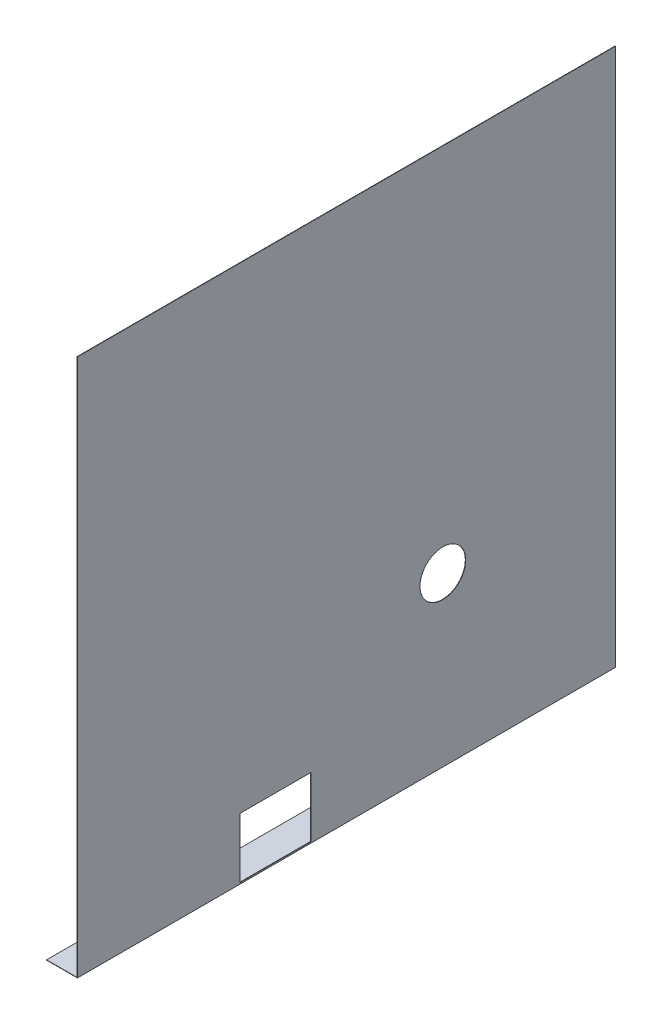
ISO-10303-21;
HEADER;
FILE_DESCRIPTION(('STEP AP214'),'2;1');
FILE_NAME('part.step','',(''),(''),'','','');
FILE_SCHEMA(('AUTOMOTIVE_DESIGN { 1 0 10303 214 1 1 1 1 }'));
ENDSEC;
DATA;
#1=APPLICATION_CONTEXT('core data for automotive mechanical design processes');
#2=APPLICATION_PROTOCOL_DEFINITION('international standard','automotive_design',2000,#1);
#3=PRODUCT_CONTEXT('',#1,'mechanical');
#4=PRODUCT('Part','Part','',(#3));
#5=PRODUCT_RELATED_PRODUCT_CATEGORY('part','',(#4));
#6=PRODUCT_DEFINITION_FORMATION('','',#4);
#7=PRODUCT_DEFINITION_CONTEXT('part definition',#1,'design');
#8=PRODUCT_DEFINITION('design','',#6,#7);
#9=PRODUCT_DEFINITION_SHAPE('','',#8);
#10=(LENGTH_UNIT() NAMED_UNIT(*) SI_UNIT(.MILLI.,.METRE.));
#11=(NAMED_UNIT(*) PLANE_ANGLE_UNIT() SI_UNIT($,.RADIAN.));
#12=(NAMED_UNIT(*) SI_UNIT($,.STERADIAN.) SOLID_ANGLE_UNIT());
#13=UNCERTAINTY_MEASURE_WITH_UNIT(LENGTH_MEASURE(1.E-05),#10,'distance_accuracy_value','');
#14=(GEOMETRIC_REPRESENTATION_CONTEXT(3) GLOBAL_UNCERTAINTY_ASSIGNED_CONTEXT((#13)) GLOBAL_UNIT_ASSIGNED_CONTEXT((#10,
#11,#12)) REPRESENTATION_CONTEXT('',''));
#15=CARTESIAN_POINT('',(0.,0.,0.));
#16=DIRECTION('',(0.,0.,1.));
#17=DIRECTION('',(1.,0.,0.));
#18=AXIS2_PLACEMENT_3D('',#15,#16,#17);
#19=CARTESIAN_POINT('',(-30.3499999999999,0.,530.));
#20=DIRECTION('',(0.,1.,0.));
#21=DIRECTION('',(0.,0.,1.));
#22=AXIS2_PLACEMENT_3D('',#19,#20,#21);
#23=PLANE('',#22);
#24=DIRECTION('',(1.,0.,0.));
#25=VECTOR('',#24,1.);
#26=CARTESIAN_POINT('',(-30.3499999999999,0.,0.));
#27=LINE('',#26,#25);
#28=CARTESIAN_POINT('',(-30.3499999999999,0.,0.));
#29=VERTEX_POINT('',#28);
#30=CARTESIAN_POINT('',(0.,0.,0.));
#31=VERTEX_POINT('',#30);
#32=EDGE_CURVE('E172',#29,#31,#27,.T.);
#33=ORIENTED_EDGE('',*,*,#32,.T.);
#34=DIRECTION('',(0.,0.,-1.));
#35=VECTOR('',#34,1.);
#36=CARTESIAN_POINT('',(0.,0.,530.));
#37=LINE('',#36,#35);
#38=CARTESIAN_POINT('',(0.,0.,530.));
#39=VERTEX_POINT('',#38);
#40=EDGE_CURVE('E11',#39,#31,#37,.T.);
#41=ORIENTED_EDGE('',*,*,#40,.F.);
#42=DIRECTION('',(1.,0.,0.));
#43=VECTOR('',#42,1.);
#44=CARTESIAN_POINT('',(-30.3499999999999,0.,530.));
#45=LINE('',#44,#43);
#46=CARTESIAN_POINT('',(-30.3499999999999,0.,530.));
#47=VERTEX_POINT('',#46);
#48=EDGE_CURVE('E173',#47,#39,#45,.T.);
#49=ORIENTED_EDGE('',*,*,#48,.F.);
#50=DIRECTION('',(0.,0.,-1.));
#51=VECTOR('',#50,1.);
#52=CARTESIAN_POINT('',(-30.3499999999999,0.,530.));
#53=LINE('',#52,#51);
#54=EDGE_CURVE('E193',#47,#29,#53,.T.);
#55=ORIENTED_EDGE('',*,*,#54,.T.);
#56=EDGE_LOOP('',(#33,#41,#49,#55));
#57=FACE_BOUND('',#56,.T.);
#58=ADVANCED_FACE('F39',(#57),#23,.F.);
#59=CARTESIAN_POINT('',(0.,0.,530.));
#60=DIRECTION('',(-1.,0.,0.));
#61=DIRECTION('',(0.,0.,1.));
#62=AXIS2_PLACEMENT_3D('',#59,#60,#61);
#63=PLANE('',#62);
#64=DIRECTION('',(0.,-1.,0.));
#65=VECTOR('',#64,1.);
#66=CARTESIAN_POINT('',(0.,-2.16399403104903E-13,300.));
#67=LINE('',#66,#65);
#68=CARTESIAN_POINT('',(0.,60.35,300.));
#69=VERTEX_POINT('',#68);
#70=CARTESIAN_POINT('',(0.,1.34999999999999,300.));
#71=VERTEX_POINT('',#70);
#72=EDGE_CURVE('E156',#69,#71,#67,.T.);
#73=ORIENTED_EDGE('',*,*,#72,.T.);
#74=DIRECTION('',(0.,0.,1.));
#75=VECTOR('',#74,1.);
#76=CARTESIAN_POINT('',(0.,1.35000000000006,530.));
#77=LINE('',#76,#75);
#78=CARTESIAN_POINT('',(0.,1.35000000000001,370.));
#79=VERTEX_POINT('',#78);
#80=EDGE_CURVE('E160',#71,#79,#77,.T.);
#81=ORIENTED_EDGE('',*,*,#80,.T.);
#82=DIRECTION('',(0.,1.,0.));
#83=VECTOR('',#82,1.);
#84=CARTESIAN_POINT('',(0.,0.,370.));
#85=LINE('',#84,#83);
#86=CARTESIAN_POINT('',(0.,60.3500000000001,370.));
#87=VERTEX_POINT('',#86);
#88=EDGE_CURVE('E147',#79,#87,#85,.T.);
#89=ORIENTED_EDGE('',*,*,#88,.T.);
#90=DIRECTION('',(0.,0.,-1.));
#91=VECTOR('',#90,1.);
#92=CARTESIAN_POINT('',(0.,60.35,530.));
#93=LINE('',#92,#91);
#94=EDGE_CURVE('E122',#87,#69,#93,.T.);
#95=ORIENTED_EDGE('',*,*,#94,.T.);
#96=EDGE_LOOP('',(#73,#81,#89,#95));
#97=FACE_BOUND('',#96,.T.);
#98=CARTESIAN_POINT('',(0.,165.35,170.));
#99=DIRECTION('',(-1.,0.,0.));
#100=DIRECTION('',(0.,0.,1.));
#101=AXIS2_PLACEMENT_3D('',#98,#99,#100);
#102=CIRCLE('',#101,22.5);
#103=CARTESIAN_POINT('',(0.,165.35,192.5));
#104=VERTEX_POINT('',#103);
#105=EDGE_CURVE('E168',#104,#104,#102,.T.);
#106=ORIENTED_EDGE('',*,*,#105,.T.);
#107=EDGE_LOOP('',(#106));
#108=FACE_BOUND('',#107,.T.);
#109=DIRECTION('',(0.,1.,0.));
#110=VECTOR('',#109,1.);
#111=CARTESIAN_POINT('',(0.,0.,0.));
#112=LINE('',#111,#110);
#113=CARTESIAN_POINT('',(0.,530.,0.));
#114=VERTEX_POINT('',#113);
#115=EDGE_CURVE('E197',#31,#114,#112,.T.);
#116=ORIENTED_EDGE('',*,*,#115,.T.);
#117=DIRECTION('',(0.,0.,-1.));
#118=VECTOR('',#117,1.);
#119=CARTESIAN_POINT('',(0.,530.,530.));
#120=LINE('',#119,#118);
#121=CARTESIAN_POINT('',(0.,530.,530.));
#122=VERTEX_POINT('',#121);
#123=EDGE_CURVE('E47',#122,#114,#120,.T.);
#124=ORIENTED_EDGE('',*,*,#123,.F.);
#125=DIRECTION('',(0.,1.,0.));
#126=VECTOR('',#125,1.);
#127=CARTESIAN_POINT('',(0.,0.,530.));
#128=LINE('',#127,#126);
#129=EDGE_CURVE('E177',#39,#122,#128,.T.);
#130=ORIENTED_EDGE('',*,*,#129,.F.);
#131=ORIENTED_EDGE('',*,*,#40,.T.);
#132=EDGE_LOOP('',(#116,#124,#130,#131));
#133=FACE_BOUND('',#132,.T.);
#134=ADVANCED_FACE('F253',(#97,#108,#133),#63,.F.);
#135=CARTESIAN_POINT('',(0.,530.,530.));
#136=DIRECTION('',(0.,-1.,0.));
#137=DIRECTION('',(0.,0.,-1.));
#138=AXIS2_PLACEMENT_3D('',#135,#136,#137);
#139=PLANE('',#138);
#140=DIRECTION('',(-1.,0.,0.));
#141=VECTOR('',#140,1.);
#142=CARTESIAN_POINT('',(0.,530.,0.));
#143=LINE('',#142,#141);
#144=CARTESIAN_POINT('',(-0.349999999999989,530.,0.));
#145=VERTEX_POINT('',#144);
#146=EDGE_CURVE('E200',#114,#145,#143,.T.);
#147=ORIENTED_EDGE('',*,*,#146,.T.);
#148=DIRECTION('',(0.,0.,-1.));
#149=VECTOR('',#148,1.);
#150=CARTESIAN_POINT('',(-0.349999999999989,530.,530.));
#151=LINE('',#150,#149);
#152=CARTESIAN_POINT('',(-0.349999999999989,530.,530.));
#153=VERTEX_POINT('',#152);
#154=EDGE_CURVE('E222',#153,#145,#151,.T.);
#155=ORIENTED_EDGE('',*,*,#154,.F.);
#156=DIRECTION('',(-1.,0.,0.));
#157=VECTOR('',#156,1.);
#158=CARTESIAN_POINT('',(0.,530.,530.));
#159=LINE('',#158,#157);
#160=EDGE_CURVE('E181',#122,#153,#159,.T.);
#161=ORIENTED_EDGE('',*,*,#160,.F.);
#162=ORIENTED_EDGE('',*,*,#123,.T.);
#163=EDGE_LOOP('',(#147,#155,#161,#162));
#164=FACE_BOUND('',#163,.T.);
#165=ADVANCED_FACE('F231',(#164),#139,.F.);
#166=CARTESIAN_POINT('',(-0.349999999999989,530.,530.));
#167=DIRECTION('',(1.,0.,0.));
#168=DIRECTION('',(0.,1.,0.));
#169=AXIS2_PLACEMENT_3D('',#166,#167,#168);
#170=PLANE('',#169);
#171=DIRECTION('',(0.,1.,0.));
#172=VECTOR('',#171,1.);
#173=CARTESIAN_POINT('',(-0.349999999999909,60.35,370.));
#174=LINE('',#173,#172);
#175=CARTESIAN_POINT('',(-0.349999999999899,1.35000000000007,370.));
#176=VERTEX_POINT('',#175);
#177=CARTESIAN_POINT('',(-0.349999999999909,60.35,370.));
#178=VERTEX_POINT('',#177);
#179=EDGE_CURVE('E129',#176,#178,#174,.T.);
#180=ORIENTED_EDGE('',*,*,#179,.F.);
#181=DIRECTION('',(0.,0.,1.));
#182=VECTOR('',#181,1.);
#183=CARTESIAN_POINT('',(-0.349999999999899,1.35000000000001,370.));
#184=LINE('',#183,#182);
#185=CARTESIAN_POINT('',(-0.349999999999899,1.34999999999999,300.));
#186=VERTEX_POINT('',#185);
#187=EDGE_CURVE('E62',#186,#176,#184,.T.);
#188=ORIENTED_EDGE('',*,*,#187,.F.);
#189=DIRECTION('',(0.,-1.,0.));
#190=VECTOR('',#189,1.);
#191=CARTESIAN_POINT('',(-0.349999999999899,1.34999999999999,300.));
#192=LINE('',#191,#190);
#193=CARTESIAN_POINT('',(-0.349999999999909,60.35,300.));
#194=VERTEX_POINT('',#193);
#195=EDGE_CURVE('E137',#194,#186,#192,.T.);
#196=ORIENTED_EDGE('',*,*,#195,.F.);
#197=DIRECTION('',(0.,0.,-1.));
#198=VECTOR('',#197,1.);
#199=CARTESIAN_POINT('',(-0.349999999999909,60.35,300.));
#200=LINE('',#199,#198);
#201=EDGE_CURVE('E119',#178,#194,#200,.T.);
#202=ORIENTED_EDGE('',*,*,#201,.F.);
#203=EDGE_LOOP('',(#180,#188,#196,#202));
#204=FACE_BOUND('',#203,.T.);
#205=CARTESIAN_POINT('',(-0.349999999999927,165.35,170.));
#206=DIRECTION('',(-1.,0.,0.));
#207=DIRECTION('',(0.,-1.,0.));
#208=AXIS2_PLACEMENT_3D('',#205,#206,#207);
#209=CIRCLE('',#208,22.5);
#210=CARTESIAN_POINT('',(-0.349999999999923,142.85,170.));
#211=VERTEX_POINT('',#210);
#212=EDGE_CURVE('E164',#211,#211,#209,.T.);
#213=ORIENTED_EDGE('',*,*,#212,.F.);
#214=EDGE_LOOP('',(#213));
#215=FACE_BOUND('',#214,.T.);
#216=DIRECTION('',(0.,-1.,0.));
#217=VECTOR('',#216,1.);
#218=CARTESIAN_POINT('',(-0.349999999999989,530.,0.));
#219=LINE('',#218,#217);
#220=CARTESIAN_POINT('',(-0.349999999999899,0.35000000000001,0.));
#221=VERTEX_POINT('',#220);
#222=EDGE_CURVE('E203',#145,#221,#219,.T.);
#223=ORIENTED_EDGE('',*,*,#222,.T.);
#224=DIRECTION('',(0.,0.,-1.));
#225=VECTOR('',#224,1.);
#226=CARTESIAN_POINT('',(-0.349999999999899,0.35000000000001,530.));
#227=LINE('',#226,#225);
#228=CARTESIAN_POINT('',(-0.349999999999899,0.35000000000001,530.));
#229=VERTEX_POINT('',#228);
#230=EDGE_CURVE('E218',#229,#221,#227,.T.);
#231=ORIENTED_EDGE('',*,*,#230,.F.);
#232=DIRECTION('',(0.,-1.,0.));
#233=VECTOR('',#232,1.);
#234=CARTESIAN_POINT('',(-0.349999999999989,530.,530.));
#235=LINE('',#234,#233);
#236=EDGE_CURVE('E184',#153,#229,#235,.T.);
#237=ORIENTED_EDGE('',*,*,#236,.F.);
#238=ORIENTED_EDGE('',*,*,#154,.T.);
#239=EDGE_LOOP('',(#223,#231,#237,#238));
#240=FACE_BOUND('',#239,.T.);
#241=ADVANCED_FACE('F134',(#204,#215,#240),#170,.F.);
#242=CARTESIAN_POINT('',(-0.349999999999899,0.35000000000001,530.));
#243=DIRECTION('',(0.,-1.,0.));
#244=DIRECTION('',(1.,0.,0.));
#245=AXIS2_PLACEMENT_3D('',#242,#243,#244);
#246=PLANE('',#245);
#247=DIRECTION('',(-1.,0.,0.));
#248=VECTOR('',#247,1.);
#249=CARTESIAN_POINT('',(-0.349999999999899,0.35000000000001,0.));
#250=LINE('',#249,#248);
#251=CARTESIAN_POINT('',(-30.3499999999999,0.350000000000003,0.));
#252=VERTEX_POINT('',#251);
#253=EDGE_CURVE('E206',#221,#252,#250,.T.);
#254=ORIENTED_EDGE('',*,*,#253,.T.);
#255=DIRECTION('',(0.,0.,-1.));
#256=VECTOR('',#255,1.);
#257=CARTESIAN_POINT('',(-30.3499999999999,0.350000000000003,530.));
#258=LINE('',#257,#256);
#259=CARTESIAN_POINT('',(-30.3499999999999,0.350000000000003,530.));
#260=VERTEX_POINT('',#259);
#261=EDGE_CURVE('E214',#260,#252,#258,.T.);
#262=ORIENTED_EDGE('',*,*,#261,.F.);
#263=DIRECTION('',(-1.,0.,0.));
#264=VECTOR('',#263,1.);
#265=CARTESIAN_POINT('',(-0.349999999999899,0.35000000000001,530.));
#266=LINE('',#265,#264);
#267=EDGE_CURVE('E187',#229,#260,#266,.T.);
#268=ORIENTED_EDGE('',*,*,#267,.F.);
#269=ORIENTED_EDGE('',*,*,#230,.T.);
#270=EDGE_LOOP('',(#254,#262,#268,#269));
#271=FACE_BOUND('',#270,.T.);
#272=ADVANCED_FACE('F245',(#271),#246,.F.);
#273=CARTESIAN_POINT('',(-30.3499999999999,0.350000000000003,530.));
#274=DIRECTION('',(1.,0.,0.));
#275=DIRECTION('',(0.,1.,0.));
#276=AXIS2_PLACEMENT_3D('',#273,#274,#275);
#277=PLANE('',#276);
#278=DIRECTION('',(0.,-1.,0.));
#279=VECTOR('',#278,1.);
#280=CARTESIAN_POINT('',(-30.3499999999999,0.350000000000003,0.));
#281=LINE('',#280,#279);
#282=EDGE_CURVE('E178',#252,#29,#281,.T.);
#283=ORIENTED_EDGE('',*,*,#282,.T.);
#284=ORIENTED_EDGE('',*,*,#54,.F.);
#285=DIRECTION('',(0.,-1.,0.));
#286=VECTOR('',#285,1.);
#287=CARTESIAN_POINT('',(-30.3499999999999,0.350000000000003,530.));
#288=LINE('',#287,#286);
#289=EDGE_CURVE('E190',#260,#47,#288,.T.);
#290=ORIENTED_EDGE('',*,*,#289,.F.);
#291=ORIENTED_EDGE('',*,*,#261,.T.);
#292=EDGE_LOOP('',(#283,#284,#290,#291));
#293=FACE_BOUND('',#292,.T.);
#294=ADVANCED_FACE('F256',(#293),#277,.F.);
#295=CARTESIAN_POINT('',(0.,0.,530.));
#296=DIRECTION('',(0.,0.,1.));
#297=DIRECTION('',(1.,0.,0.));
#298=AXIS2_PLACEMENT_3D('',#295,#296,#297);
#299=PLANE('',#298);
#300=ORIENTED_EDGE('',*,*,#48,.T.);
#301=ORIENTED_EDGE('',*,*,#129,.T.);
#302=ORIENTED_EDGE('',*,*,#160,.T.);
#303=ORIENTED_EDGE('',*,*,#236,.T.);
#304=ORIENTED_EDGE('',*,*,#267,.T.);
#305=ORIENTED_EDGE('',*,*,#289,.T.);
#306=EDGE_LOOP('',(#300,#301,#302,#303,#304,#305));
#307=FACE_BOUND('',#306,.T.);
#308=ADVANCED_FACE('F249',(#307),#299,.T.);
#309=CARTESIAN_POINT('',(0.,0.,0.));
#310=DIRECTION('',(0.,0.,1.));
#311=DIRECTION('',(1.,0.,0.));
#312=AXIS2_PLACEMENT_3D('',#309,#310,#311);
#313=PLANE('',#312);
#314=ORIENTED_EDGE('',*,*,#32,.F.);
#315=ORIENTED_EDGE('',*,*,#282,.F.);
#316=ORIENTED_EDGE('',*,*,#253,.F.);
#317=ORIENTED_EDGE('',*,*,#222,.F.);
#318=ORIENTED_EDGE('',*,*,#146,.F.);
#319=ORIENTED_EDGE('',*,*,#115,.F.);
#320=EDGE_LOOP('',(#314,#315,#316,#317,#318,#319));
#321=FACE_BOUND('',#320,.T.);
#322=ADVANCED_FACE('F237',(#321),#313,.F.);
#323=CARTESIAN_POINT('',(529.65,165.35,170.));
#324=DIRECTION('',(-1.,0.,0.));
#325=DIRECTION('',(0.,-1.,0.));
#326=AXIS2_PLACEMENT_3D('',#323,#324,#325);
#327=CYLINDRICAL_SURFACE('',#326,22.5);
#328=ORIENTED_EDGE('',*,*,#212,.T.);
#329=EDGE_LOOP('',(#328));
#330=FACE_BOUND('',#329,.T.);
#331=ORIENTED_EDGE('',*,*,#105,.F.);
#332=EDGE_LOOP('',(#331));
#333=FACE_BOUND('',#332,.T.);
#334=ADVANCED_FACE('F308',(#330,#333),#327,.F.);
#335=CARTESIAN_POINT('',(529.65,1.3500000000001,370.));
#336=DIRECTION('',(0.,-1.,0.));
#337=DIRECTION('',(0.,0.,-1.));
#338=AXIS2_PLACEMENT_3D('',#335,#336,#337);
#339=PLANE('',#338);
#340=DIRECTION('',(-1.,0.,0.));
#341=VECTOR('',#340,1.);
#342=CARTESIAN_POINT('',(529.65,1.35000000000008,300.));
#343=LINE('',#342,#341);
#344=EDGE_CURVE('E144',#71,#186,#343,.T.);
#345=ORIENTED_EDGE('',*,*,#344,.T.);
#346=ORIENTED_EDGE('',*,*,#187,.T.);
#347=DIRECTION('',(-1.,0.,0.));
#348=VECTOR('',#347,1.);
#349=CARTESIAN_POINT('',(529.65,1.3500000000001,370.));
#350=LINE('',#349,#348);
#351=EDGE_CURVE('E126',#79,#176,#350,.T.);
#352=ORIENTED_EDGE('',*,*,#351,.F.);
#353=ORIENTED_EDGE('',*,*,#80,.F.);
#354=EDGE_LOOP('',(#345,#346,#352,#353));
#355=FACE_BOUND('',#354,.T.);
#356=ADVANCED_FACE('F315',(#355),#339,.F.);
#357=CARTESIAN_POINT('',(529.65,1.35000000000008,300.));
#358=DIRECTION('',(0.,0.,-1.));
#359=DIRECTION('',(0.,1.,0.));
#360=AXIS2_PLACEMENT_3D('',#357,#358,#359);
#361=PLANE('',#360);
#362=DIRECTION('',(-1.,0.,0.));
#363=VECTOR('',#362,1.);
#364=CARTESIAN_POINT('',(529.65,60.3500000000001,300.));
#365=LINE('',#364,#363);
#366=EDGE_CURVE('E125',#69,#194,#365,.T.);
#367=ORIENTED_EDGE('',*,*,#366,.T.);
#368=ORIENTED_EDGE('',*,*,#195,.T.);
#369=ORIENTED_EDGE('',*,*,#344,.F.);
#370=ORIENTED_EDGE('',*,*,#72,.F.);
#371=EDGE_LOOP('',(#367,#368,#369,#370));
#372=FACE_BOUND('',#371,.T.);
#373=ADVANCED_FACE('F337',(#372),#361,.F.);
#374=CARTESIAN_POINT('',(529.65,60.3500000000001,300.));
#375=DIRECTION('',(0.,1.,0.));
#376=DIRECTION('',(-1.,0.,0.));
#377=AXIS2_PLACEMENT_3D('',#374,#375,#376);
#378=PLANE('',#377);
#379=DIRECTION('',(-1.,0.,0.));
#380=VECTOR('',#379,1.);
#381=CARTESIAN_POINT('',(529.65,60.3500000000001,370.));
#382=LINE('',#381,#380);
#383=EDGE_CURVE('E54',#87,#178,#382,.T.);
#384=ORIENTED_EDGE('',*,*,#383,.T.);
#385=ORIENTED_EDGE('',*,*,#201,.T.);
#386=ORIENTED_EDGE('',*,*,#366,.F.);
#387=ORIENTED_EDGE('',*,*,#94,.F.);
#388=EDGE_LOOP('',(#384,#385,#386,#387));
#389=FACE_BOUND('',#388,.T.);
#390=ADVANCED_FACE('F116',(#389),#378,.F.);
#391=CARTESIAN_POINT('',(529.65,60.3500000000001,370.));
#392=DIRECTION('',(0.,0.,1.));
#393=DIRECTION('',(1.,0.,0.));
#394=AXIS2_PLACEMENT_3D('',#391,#392,#393);
#395=PLANE('',#394);
#396=ORIENTED_EDGE('',*,*,#351,.T.);
#397=ORIENTED_EDGE('',*,*,#179,.T.);
#398=ORIENTED_EDGE('',*,*,#383,.F.);
#399=ORIENTED_EDGE('',*,*,#88,.F.);
#400=EDGE_LOOP('',(#396,#397,#398,#399));
#401=FACE_BOUND('',#400,.T.);
#402=ADVANCED_FACE('F130',(#401),#395,.F.);
#403=CLOSED_SHELL('',(#58,#134,#165,#241,#272,#294,#308,#322,#334,#356,#373,#390,#402));
#404=MANIFOLD_SOLID_BREP('B2',#403);
#405=ADVANCED_BREP_SHAPE_REPRESENTATION('',(#18,#404),#14);
#406=SHAPE_DEFINITION_REPRESENTATION(#9,#405);
ENDSEC;
END-ISO-10303-21;
